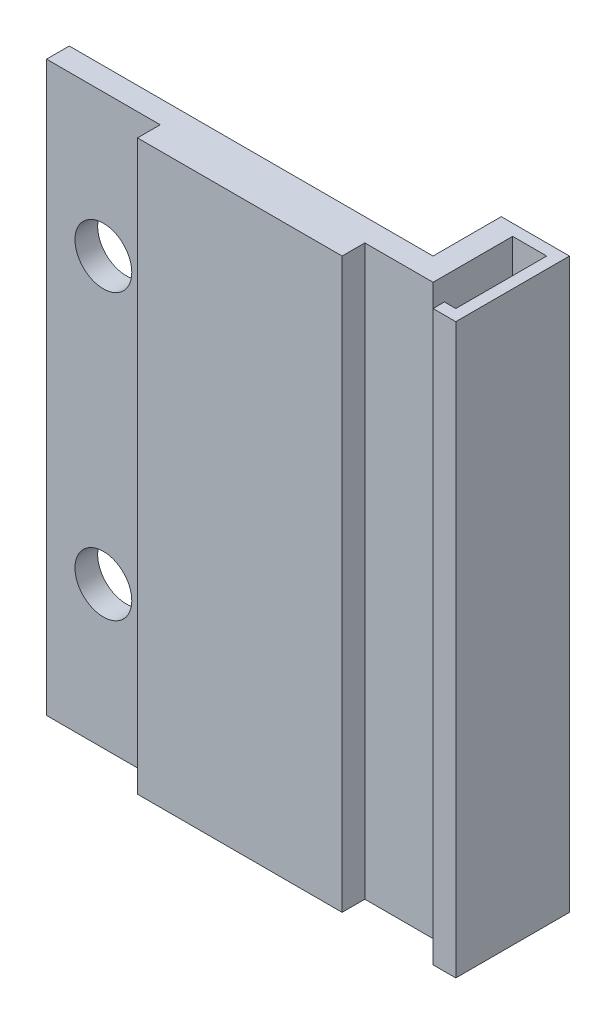
ISO-10303-21;
HEADER;
FILE_DESCRIPTION(('STEP AP214'),'2;1');
FILE_NAME('part.step','',(''),(''),'','','');
FILE_SCHEMA(('AUTOMOTIVE_DESIGN { 1 0 10303 214 1 1 1 1 }'));
ENDSEC;
DATA;
#1=APPLICATION_CONTEXT('core data for automotive mechanical design processes');
#2=APPLICATION_PROTOCOL_DEFINITION('international standard','automotive_design',2000,#1);
#3=PRODUCT_CONTEXT('',#1,'mechanical');
#4=PRODUCT('Part','Part','',(#3));
#5=PRODUCT_RELATED_PRODUCT_CATEGORY('part','',(#4));
#6=PRODUCT_DEFINITION_FORMATION('','',#4);
#7=PRODUCT_DEFINITION_CONTEXT('part definition',#1,'design');
#8=PRODUCT_DEFINITION('design','',#6,#7);
#9=PRODUCT_DEFINITION_SHAPE('','',#8);
#10=(LENGTH_UNIT() NAMED_UNIT(*) SI_UNIT(.MILLI.,.METRE.));
#11=(NAMED_UNIT(*) PLANE_ANGLE_UNIT() SI_UNIT($,.RADIAN.));
#12=(NAMED_UNIT(*) SI_UNIT($,.STERADIAN.) SOLID_ANGLE_UNIT());
#13=UNCERTAINTY_MEASURE_WITH_UNIT(LENGTH_MEASURE(1.E-05),#10,'distance_accuracy_value','');
#14=(GEOMETRIC_REPRESENTATION_CONTEXT(3) GLOBAL_UNCERTAINTY_ASSIGNED_CONTEXT((#13)) GLOBAL_UNIT_ASSIGNED_CONTEXT((#10,
#11,#12)) REPRESENTATION_CONTEXT('',''));
#15=CARTESIAN_POINT('',(0.,0.,0.));
#16=DIRECTION('',(0.,0.,1.));
#17=DIRECTION('',(1.,0.,0.));
#18=AXIS2_PLACEMENT_3D('',#15,#16,#17);
#19=CARTESIAN_POINT('',(37.,50.0000000000001,4.));
#20=DIRECTION('',(1.,0.,0.));
#21=DIRECTION('',(0.,1.,0.));
#22=AXIS2_PLACEMENT_3D('',#19,#20,#21);
#23=PLANE('',#22);
#24=DIRECTION('',(0.,-1.,0.));
#25=VECTOR('',#24,1.);
#26=CARTESIAN_POINT('',(37.,50.,3.));
#27=LINE('',#26,#25);
#28=CARTESIAN_POINT('',(37.,50.,3.));
#29=VERTEX_POINT('',#28);
#30=CARTESIAN_POINT('',(37.,0.,3.));
#31=VERTEX_POINT('',#30);
#32=EDGE_CURVE('E180',#29,#31,#27,.T.);
#33=ORIENTED_EDGE('',*,*,#32,.F.);
#34=DIRECTION('',(0.,0.,-1.));
#35=VECTOR('',#34,1.);
#36=CARTESIAN_POINT('',(37.,50.0000000000001,4.));
#37=LINE('',#36,#35);
#38=CARTESIAN_POINT('',(37.,50.0000000000001,-5.));
#39=VERTEX_POINT('',#38);
#40=EDGE_CURVE('E197',#29,#39,#37,.T.);
#41=ORIENTED_EDGE('',*,*,#40,.T.);
#42=DIRECTION('',(0.,-1.,0.));
#43=VECTOR('',#42,1.);
#44=CARTESIAN_POINT('',(37.,50.0000000000001,-5.));
#45=LINE('',#44,#43);
#46=CARTESIAN_POINT('',(37.,0.,-5.));
#47=VERTEX_POINT('',#46);
#48=EDGE_CURVE('E190',#39,#47,#45,.T.);
#49=ORIENTED_EDGE('',*,*,#48,.T.);
#50=DIRECTION('',(0.,0.,-1.));
#51=VECTOR('',#50,1.);
#52=CARTESIAN_POINT('',(36.9999999999999,0.,4.00000000000017));
#53=LINE('',#52,#51);
#54=EDGE_CURVE('E193',#31,#47,#53,.T.);
#55=ORIENTED_EDGE('',*,*,#54,.F.);
#56=EDGE_LOOP('',(#33,#41,#49,#55));
#57=FACE_BOUND('',#56,.T.);
#58=ADVANCED_FACE('F38',(#57),#23,.F.);
#59=CARTESIAN_POINT('',(38.,50.,-4.99999999999995));
#60=DIRECTION('',(0.,0.,-1.));
#61=DIRECTION('',(0.,1.,0.));
#62=AXIS2_PLACEMENT_3D('',#59,#60,#61);
#63=PLANE('',#62);
#64=ORIENTED_EDGE('',*,*,#48,.F.);
#65=DIRECTION('',(-1.,0.,0.));
#66=VECTOR('',#65,1.);
#67=CARTESIAN_POINT('',(38.,50.,-4.99999999999995));
#68=LINE('',#67,#66);
#69=CARTESIAN_POINT('',(34.,50.,-4.99999999999995));
#70=VERTEX_POINT('',#69);
#71=EDGE_CURVE('E53',#39,#70,#68,.T.);
#72=ORIENTED_EDGE('',*,*,#71,.T.);
#73=DIRECTION('',(0.,-1.,0.));
#74=VECTOR('',#73,1.);
#75=CARTESIAN_POINT('',(34.,50.,-4.99999999999995));
#76=LINE('',#75,#74);
#77=CARTESIAN_POINT('',(33.9999999999999,0.,-4.99999999999978));
#78=VERTEX_POINT('',#77);
#79=EDGE_CURVE('E199',#70,#78,#76,.T.);
#80=ORIENTED_EDGE('',*,*,#79,.T.);
#81=DIRECTION('',(-1.,0.,0.));
#82=VECTOR('',#81,1.);
#83=CARTESIAN_POINT('',(38.,0.,-5.));
#84=LINE('',#83,#82);
#85=EDGE_CURVE('E208',#47,#78,#84,.T.);
#86=ORIENTED_EDGE('',*,*,#85,.F.);
#87=EDGE_LOOP('',(#64,#72,#80,#86));
#88=FACE_BOUND('',#87,.T.);
#89=ADVANCED_FACE('F326',(#88),#63,.F.);
#90=CARTESIAN_POINT('',(0.,0.,4.00000000000011));
#91=DIRECTION('',(0.,0.,-1.));
#92=DIRECTION('',(-1.,0.,0.));
#93=AXIS2_PLACEMENT_3D('',#90,#91,#92);
#94=PLANE('',#93);
#95=DIRECTION('',(0.,-1.,0.));
#96=VECTOR('',#95,1.);
#97=CARTESIAN_POINT('',(28.,50.,4.));
#98=LINE('',#97,#96);
#99=CARTESIAN_POINT('',(28.,50.,4.));
#100=VERTEX_POINT('',#99);
#101=CARTESIAN_POINT('',(28.,0.,4.));
#102=VERTEX_POINT('',#101);
#103=EDGE_CURVE('E213',#100,#102,#98,.T.);
#104=ORIENTED_EDGE('',*,*,#103,.F.);
#105=DIRECTION('',(-1.,0.,0.));
#106=VECTOR('',#105,1.);
#107=CARTESIAN_POINT('',(12.,50.,4.));
#108=LINE('',#107,#106);
#109=CARTESIAN_POINT('',(9.99999999999998,50.,4.00000000000017));
#110=VERTEX_POINT('',#109);
#111=EDGE_CURVE('E248',#100,#110,#108,.T.);
#112=ORIENTED_EDGE('',*,*,#111,.T.);
#113=DIRECTION('',(0.,-1.,0.));
#114=VECTOR('',#113,1.);
#115=CARTESIAN_POINT('',(9.99999999999998,50.,4.00000000000017));
#116=LINE('',#115,#114);
#117=CARTESIAN_POINT('',(9.99999999999993,0.,4.00000000000023));
#118=VERTEX_POINT('',#117);
#119=EDGE_CURVE('E250',#110,#118,#116,.T.);
#120=ORIENTED_EDGE('',*,*,#119,.T.);
#121=DIRECTION('',(1.,0.,0.));
#122=VECTOR('',#121,1.);
#123=CARTESIAN_POINT('',(12.,0.,4.));
#124=LINE('',#123,#122);
#125=EDGE_CURVE('E252',#118,#102,#124,.T.);
#126=ORIENTED_EDGE('',*,*,#125,.T.);
#127=EDGE_LOOP('',(#104,#112,#120,#126));
#128=FACE_BOUND('',#127,.T.);
#129=ADVANCED_FACE('F332',(#128),#94,.F.);
#130=CARTESIAN_POINT('',(0.,0.,0.));
#131=DIRECTION('',(0.,0.,1.));
#132=DIRECTION('',(1.,0.,0.));
#133=AXIS2_PLACEMENT_3D('',#130,#131,#132);
#134=PLANE('',#133);
#135=CARTESIAN_POINT('',(4.99999999999995,12.5,1.11022302462516E-13));
#136=DIRECTION('',(0.,0.,1.));
#137=DIRECTION('',(1.,0.,0.));
#138=AXIS2_PLACEMENT_3D('',#135,#136,#137);
#139=CIRCLE('',#138,2.5);
#140=CARTESIAN_POINT('',(7.49999999999995,12.5,1.10467190950203E-13));
#141=VERTEX_POINT('',#140);
#142=EDGE_CURVE('E281',#141,#141,#139,.T.);
#143=ORIENTED_EDGE('',*,*,#142,.T.);
#144=EDGE_LOOP('',(#143));
#145=FACE_BOUND('',#144,.T.);
#146=CARTESIAN_POINT('',(4.99999999999998,37.5,0.));
#147=DIRECTION('',(0.,0.,1.));
#148=DIRECTION('',(1.,0.,0.));
#149=AXIS2_PLACEMENT_3D('',#146,#147,#148);
#150=CIRCLE('',#149,2.5);
#151=CARTESIAN_POINT('',(7.49999999999998,37.5,0.));
#152=VERTEX_POINT('',#151);
#153=EDGE_CURVE('E263',#152,#152,#150,.T.);
#154=ORIENTED_EDGE('',*,*,#153,.T.);
#155=EDGE_LOOP('',(#154));
#156=FACE_BOUND('',#155,.T.);
#157=DIRECTION('',(0.,1.,0.));
#158=VECTOR('',#157,1.);
#159=CARTESIAN_POINT('',(31.9999999999999,50.,1.11022302462516E-13));
#160=LINE('',#159,#158);
#161=CARTESIAN_POINT('',(32.,0.,0.));
#162=VERTEX_POINT('',#161);
#163=CARTESIAN_POINT('',(31.9999999999999,50.,1.11022302462516E-13));
#164=VERTEX_POINT('',#163);
#165=EDGE_CURVE('E226',#162,#164,#160,.T.);
#166=ORIENTED_EDGE('',*,*,#165,.F.);
#167=DIRECTION('',(1.,0.,0.));
#168=VECTOR('',#167,1.);
#169=CARTESIAN_POINT('',(0.,0.,0.));
#170=LINE('',#169,#168);
#171=CARTESIAN_POINT('',(0.,0.,0.));
#172=VERTEX_POINT('',#171);
#173=EDGE_CURVE('E268',#172,#162,#170,.T.);
#174=ORIENTED_EDGE('',*,*,#173,.F.);
#175=DIRECTION('',(0.,1.,0.));
#176=VECTOR('',#175,1.);
#177=CARTESIAN_POINT('',(0.,0.,0.));
#178=LINE('',#177,#176);
#179=CARTESIAN_POINT('',(0.,50.0000000000001,1.11022302462516E-13));
#180=VERTEX_POINT('',#179);
#181=EDGE_CURVE('E286',#172,#180,#178,.T.);
#182=ORIENTED_EDGE('',*,*,#181,.T.);
#183=DIRECTION('',(1.,0.,0.));
#184=VECTOR('',#183,1.);
#185=CARTESIAN_POINT('',(0.,50.0000000000001,1.11022302462516E-13));
#186=LINE('',#185,#184);
#187=EDGE_CURVE('E284',#180,#164,#186,.T.);
#188=ORIENTED_EDGE('',*,*,#187,.T.);
#189=EDGE_LOOP('',(#166,#174,#182,#188));
#190=FACE_BOUND('',#189,.T.);
#191=ADVANCED_FACE('F300',(#145,#156,#190),#134,.F.);
#192=CARTESIAN_POINT('',(0.,50.,2.));
#193=DIRECTION('',(0.,1.,0.));
#194=DIRECTION('',(0.,0.,1.));
#195=AXIS2_PLACEMENT_3D('',#192,#193,#194);
#196=PLANE('',#195);
#197=DIRECTION('',(1.,0.,0.));
#198=VECTOR('',#197,1.);
#199=CARTESIAN_POINT('',(28.,49.9999999999999,2.00000000000006));
#200=LINE('',#199,#198);
#201=CARTESIAN_POINT('',(28.,49.9999999999999,2.00000000000006));
#202=VERTEX_POINT('',#201);
#203=CARTESIAN_POINT('',(33.9999999999999,50.,2.00000000000017));
#204=VERTEX_POINT('',#203);
#205=EDGE_CURVE('E224',#202,#204,#200,.T.);
#206=ORIENTED_EDGE('',*,*,#205,.T.);
#207=DIRECTION('',(0.,0.,1.));
#208=VECTOR('',#207,1.);
#209=CARTESIAN_POINT('',(33.9999999999999,50.,4.00000000000006));
#210=LINE('',#209,#208);
#211=EDGE_CURVE('E245',#70,#204,#210,.T.);
#212=ORIENTED_EDGE('',*,*,#211,.F.);
#213=ORIENTED_EDGE('',*,*,#71,.F.);
#214=ORIENTED_EDGE('',*,*,#40,.F.);
#215=DIRECTION('',(1.,0.,0.));
#216=VECTOR('',#215,1.);
#217=CARTESIAN_POINT('',(36.,50.,3.));
#218=LINE('',#217,#216);
#219=CARTESIAN_POINT('',(36.,50.,3.));
#220=VERTEX_POINT('',#219);
#221=EDGE_CURVE('E171',#220,#29,#218,.T.);
#222=ORIENTED_EDGE('',*,*,#221,.F.);
#223=DIRECTION('',(0.,0.,-1.));
#224=VECTOR('',#223,1.);
#225=CARTESIAN_POINT('',(36.,50.,4.));
#226=LINE('',#225,#224);
#227=CARTESIAN_POINT('',(36.,50.,4.));
#228=VERTEX_POINT('',#227);
#229=EDGE_CURVE('E167',#228,#220,#226,.T.);
#230=ORIENTED_EDGE('',*,*,#229,.F.);
#231=DIRECTION('',(-1.,0.,0.));
#232=VECTOR('',#231,1.);
#233=CARTESIAN_POINT('',(38.,50.,4.));
#234=LINE('',#233,#232);
#235=CARTESIAN_POINT('',(38.,50.,4.));
#236=VERTEX_POINT('',#235);
#237=EDGE_CURVE('E154',#236,#228,#234,.T.);
#238=ORIENTED_EDGE('',*,*,#237,.F.);
#239=DIRECTION('',(0.,0.,1.));
#240=VECTOR('',#239,1.);
#241=CARTESIAN_POINT('',(38.,50.,-6.00000000000001));
#242=LINE('',#241,#240);
#243=CARTESIAN_POINT('',(38.,50.,-6.00000000000001));
#244=VERTEX_POINT('',#243);
#245=EDGE_CURVE('E203',#244,#236,#242,.T.);
#246=ORIENTED_EDGE('',*,*,#245,.F.);
#247=DIRECTION('',(1.,0.,0.));
#248=VECTOR('',#247,1.);
#249=CARTESIAN_POINT('',(33.9999999999999,49.9999999999999,-5.99999999999995));
#250=LINE('',#249,#248);
#251=CARTESIAN_POINT('',(31.9999999999999,50.,-5.99999999999995));
#252=VERTEX_POINT('',#251);
#253=EDGE_CURVE('E232',#252,#244,#250,.T.);
#254=ORIENTED_EDGE('',*,*,#253,.F.);
#255=DIRECTION('',(0.,0.,1.));
#256=VECTOR('',#255,1.);
#257=CARTESIAN_POINT('',(31.9999999999999,50.,-5.99999999999995));
#258=LINE('',#257,#256);
#259=EDGE_CURVE('E234',#252,#164,#258,.T.);
#260=ORIENTED_EDGE('',*,*,#259,.T.);
#261=ORIENTED_EDGE('',*,*,#187,.F.);
#262=DIRECTION('',(0.,0.,-1.));
#263=VECTOR('',#262,1.);
#264=CARTESIAN_POINT('',(0.,50.,2.));
#265=LINE('',#264,#263);
#266=CARTESIAN_POINT('',(0.,50.,2.));
#267=VERTEX_POINT('',#266);
#268=EDGE_CURVE('E11',#267,#180,#265,.T.);
#269=ORIENTED_EDGE('',*,*,#268,.F.);
#270=DIRECTION('',(1.,0.,0.));
#271=VECTOR('',#270,1.);
#272=CARTESIAN_POINT('',(0.,50.,2.));
#273=LINE('',#272,#271);
#274=CARTESIAN_POINT('',(9.99999999999998,50.,2.00000000000006));
#275=VERTEX_POINT('',#274);
#276=EDGE_CURVE('E271',#267,#275,#273,.T.);
#277=ORIENTED_EDGE('',*,*,#276,.T.);
#278=DIRECTION('',(0.,0.,-1.));
#279=VECTOR('',#278,1.);
#280=CARTESIAN_POINT('',(9.99999999999998,50.,4.00000000000017));
#281=LINE('',#280,#279);
#282=EDGE_CURVE('E260',#110,#275,#281,.T.);
#283=ORIENTED_EDGE('',*,*,#282,.F.);
#284=ORIENTED_EDGE('',*,*,#111,.F.);
#285=DIRECTION('',(0.,0.,1.));
#286=VECTOR('',#285,1.);
#287=CARTESIAN_POINT('',(28.,50.,4.));
#288=LINE('',#287,#286);
#289=EDGE_CURVE('E221',#202,#100,#288,.T.);
#290=ORIENTED_EDGE('',*,*,#289,.F.);
#291=EDGE_LOOP('',(#206,#212,#213,#214,#222,#230,#238,#246,#254,#260,#261,#269,#277,#283,#284,#290));
#292=FACE_BOUND('',#291,.T.);
#293=ADVANCED_FACE('F169',(#292),#196,.T.);
#294=CARTESIAN_POINT('',(0.,0.,2.00000000000006));
#295=DIRECTION('',(-1.,0.,0.));
#296=DIRECTION('',(0.,0.,1.));
#297=AXIS2_PLACEMENT_3D('',#294,#295,#296);
#298=PLANE('',#297);
#299=ORIENTED_EDGE('',*,*,#181,.F.);
#300=DIRECTION('',(0.,0.,-1.));
#301=VECTOR('',#300,1.);
#302=CARTESIAN_POINT('',(0.,0.,2.00000000000006));
#303=LINE('',#302,#301);
#304=CARTESIAN_POINT('',(0.,0.,2.00000000000006));
#305=VERTEX_POINT('',#304);
#306=EDGE_CURVE('E46',#305,#172,#303,.T.);
#307=ORIENTED_EDGE('',*,*,#306,.F.);
#308=DIRECTION('',(0.,1.,0.));
#309=VECTOR('',#308,1.);
#310=CARTESIAN_POINT('',(0.,0.,2.00000000000006));
#311=LINE('',#310,#309);
#312=EDGE_CURVE('E274',#305,#267,#311,.T.);
#313=ORIENTED_EDGE('',*,*,#312,.T.);
#314=ORIENTED_EDGE('',*,*,#268,.T.);
#315=EDGE_LOOP('',(#299,#307,#313,#314));
#316=FACE_BOUND('',#315,.T.);
#317=ADVANCED_FACE('F301',(#316),#298,.T.);
#318=CARTESIAN_POINT('',(0.,0.,2.00000000000006));
#319=DIRECTION('',(0.,1.,0.));
#320=DIRECTION('',(0.,0.,1.));
#321=AXIS2_PLACEMENT_3D('',#318,#319,#320);
#322=PLANE('',#321);
#323=DIRECTION('',(0.,0.,-1.));
#324=VECTOR('',#323,1.);
#325=CARTESIAN_POINT('',(34.,0.,4.00000000000011));
#326=LINE('',#325,#324);
#327=CARTESIAN_POINT('',(34.,0.,2.));
#328=VERTEX_POINT('',#327);
#329=EDGE_CURVE('E242',#328,#78,#326,.T.);
#330=ORIENTED_EDGE('',*,*,#329,.F.);
#331=DIRECTION('',(1.,0.,0.));
#332=VECTOR('',#331,1.);
#333=CARTESIAN_POINT('',(28.,0.,2.));
#334=LINE('',#333,#332);
#335=CARTESIAN_POINT('',(28.,0.,2.));
#336=VERTEX_POINT('',#335);
#337=EDGE_CURVE('E61',#336,#328,#334,.T.);
#338=ORIENTED_EDGE('',*,*,#337,.F.);
#339=DIRECTION('',(0.,0.,-1.));
#340=VECTOR('',#339,1.);
#341=CARTESIAN_POINT('',(28.,0.,4.));
#342=LINE('',#341,#340);
#343=EDGE_CURVE('E215',#102,#336,#342,.T.);
#344=ORIENTED_EDGE('',*,*,#343,.F.);
#345=ORIENTED_EDGE('',*,*,#125,.F.);
#346=DIRECTION('',(0.,0.,-1.));
#347=VECTOR('',#346,1.);
#348=CARTESIAN_POINT('',(9.99999999999993,0.,4.00000000000023));
#349=LINE('',#348,#347);
#350=CARTESIAN_POINT('',(10.,0.,2.));
#351=VERTEX_POINT('',#350);
#352=EDGE_CURVE('E255',#118,#351,#349,.T.);
#353=ORIENTED_EDGE('',*,*,#352,.T.);
#354=DIRECTION('',(1.,0.,0.));
#355=VECTOR('',#354,1.);
#356=CARTESIAN_POINT('',(0.,0.,2.00000000000006));
#357=LINE('',#356,#355);
#358=EDGE_CURVE('E277',#305,#351,#357,.T.);
#359=ORIENTED_EDGE('',*,*,#358,.F.);
#360=ORIENTED_EDGE('',*,*,#306,.T.);
#361=ORIENTED_EDGE('',*,*,#173,.T.);
#362=DIRECTION('',(0.,0.,1.));
#363=VECTOR('',#362,1.);
#364=CARTESIAN_POINT('',(32.,0.,-6.00000000000001));
#365=LINE('',#364,#363);
#366=CARTESIAN_POINT('',(32.,0.,-6.00000000000001));
#367=VERTEX_POINT('',#366);
#368=EDGE_CURVE('E239',#367,#162,#365,.T.);
#369=ORIENTED_EDGE('',*,*,#368,.F.);
#370=DIRECTION('',(-1.,0.,0.));
#371=VECTOR('',#370,1.);
#372=CARTESIAN_POINT('',(34.,0.,-5.99999999999989));
#373=LINE('',#372,#371);
#374=CARTESIAN_POINT('',(38.,0.,-6.00000000000001));
#375=VERTEX_POINT('',#374);
#376=EDGE_CURVE('E228',#375,#367,#373,.T.);
#377=ORIENTED_EDGE('',*,*,#376,.F.);
#378=DIRECTION('',(0.,0.,-1.));
#379=VECTOR('',#378,1.);
#380=CARTESIAN_POINT('',(38.,0.,-6.00000000000001));
#381=LINE('',#380,#379);
#382=CARTESIAN_POINT('',(38.,0.,4.));
#383=VERTEX_POINT('',#382);
#384=EDGE_CURVE('E205',#383,#375,#381,.T.);
#385=ORIENTED_EDGE('',*,*,#384,.F.);
#386=DIRECTION('',(1.,0.,0.));
#387=VECTOR('',#386,1.);
#388=CARTESIAN_POINT('',(38.,0.,4.));
#389=LINE('',#388,#387);
#390=CARTESIAN_POINT('',(35.9999999999999,0.,4.00000000000006));
#391=VERTEX_POINT('',#390);
#392=EDGE_CURVE('E164',#391,#383,#389,.T.);
#393=ORIENTED_EDGE('',*,*,#392,.F.);
#394=DIRECTION('',(0.,0.,1.));
#395=VECTOR('',#394,1.);
#396=CARTESIAN_POINT('',(35.9999999999999,0.,4.00000000000006));
#397=LINE('',#396,#395);
#398=CARTESIAN_POINT('',(36.,0.,3.00000000000006));
#399=VERTEX_POINT('',#398);
#400=EDGE_CURVE('E179',#399,#391,#397,.T.);
#401=ORIENTED_EDGE('',*,*,#400,.F.);
#402=DIRECTION('',(1.,0.,0.));
#403=VECTOR('',#402,1.);
#404=CARTESIAN_POINT('',(36.,0.,3.00000000000006));
#405=LINE('',#404,#403);
#406=EDGE_CURVE('E185',#399,#31,#405,.T.);
#407=ORIENTED_EDGE('',*,*,#406,.T.);
#408=ORIENTED_EDGE('',*,*,#54,.T.);
#409=ORIENTED_EDGE('',*,*,#85,.T.);
#410=EDGE_LOOP('',(#330,#338,#344,#345,#353,#359,#360,#361,#369,#377,#385,#393,#401,#407,#408,#409));
#411=FACE_BOUND('',#410,.T.);
#412=ADVANCED_FACE('F294',(#411),#322,.F.);
#413=CARTESIAN_POINT('',(5.,12.5,2.));
#414=DIRECTION('',(0.,0.,-1.));
#415=DIRECTION('',(-1.,0.,0.));
#416=AXIS2_PLACEMENT_3D('',#413,#414,#415);
#417=CYLINDRICAL_SURFACE('',#416,2.5);
#418=CARTESIAN_POINT('',(5.,12.5,2.));
#419=DIRECTION('',(0.,0.,1.));
#420=DIRECTION('',(1.,0.,0.));
#421=AXIS2_PLACEMENT_3D('',#418,#419,#420);
#422=CIRCLE('',#421,2.5);
#423=CARTESIAN_POINT('',(7.50000000000001,12.5,2.));
#424=VERTEX_POINT('',#423);
#425=EDGE_CURVE('E267',#424,#424,#422,.T.);
#426=ORIENTED_EDGE('',*,*,#425,.T.);
#427=EDGE_LOOP('',(#426));
#428=FACE_BOUND('',#427,.T.);
#429=ORIENTED_EDGE('',*,*,#142,.F.);
#430=EDGE_LOOP('',(#429));
#431=FACE_BOUND('',#430,.T.);
#432=ADVANCED_FACE('F443',(#428,#431),#417,.F.);
#433=CARTESIAN_POINT('',(5.,37.5000000000001,2.));
#434=DIRECTION('',(0.,0.,-1.));
#435=DIRECTION('',(-1.,0.,0.));
#436=AXIS2_PLACEMENT_3D('',#433,#434,#435);
#437=CYLINDRICAL_SURFACE('',#436,2.5);
#438=CARTESIAN_POINT('',(5.,37.5000000000001,2.));
#439=DIRECTION('',(0.,0.,1.));
#440=DIRECTION('',(1.,0.,0.));
#441=AXIS2_PLACEMENT_3D('',#438,#439,#440);
#442=CIRCLE('',#441,2.5);
#443=CARTESIAN_POINT('',(7.5,37.5000000000001,2.));
#444=VERTEX_POINT('',#443);
#445=EDGE_CURVE('E264',#444,#444,#442,.T.);
#446=ORIENTED_EDGE('',*,*,#445,.T.);
#447=EDGE_LOOP('',(#446));
#448=FACE_BOUND('',#447,.T.);
#449=ORIENTED_EDGE('',*,*,#153,.F.);
#450=EDGE_LOOP('',(#449));
#451=FACE_BOUND('',#450,.T.);
#452=ADVANCED_FACE('F40',(#448,#451),#437,.F.);
#453=CARTESIAN_POINT('',(0.,0.,2.00000000000006));
#454=DIRECTION('',(0.,0.,1.));
#455=DIRECTION('',(1.,0.,0.));
#456=AXIS2_PLACEMENT_3D('',#453,#454,#455);
#457=PLANE('',#456);
#458=DIRECTION('',(0.,-1.,0.));
#459=VECTOR('',#458,1.);
#460=CARTESIAN_POINT('',(9.99999999999998,50.,2.00000000000006));
#461=LINE('',#460,#459);
#462=EDGE_CURVE('E247',#275,#351,#461,.T.);
#463=ORIENTED_EDGE('',*,*,#462,.F.);
#464=ORIENTED_EDGE('',*,*,#276,.F.);
#465=ORIENTED_EDGE('',*,*,#312,.F.);
#466=ORIENTED_EDGE('',*,*,#358,.T.);
#467=EDGE_LOOP('',(#463,#464,#465,#466));
#468=FACE_BOUND('',#467,.T.);
#469=ORIENTED_EDGE('',*,*,#445,.F.);
#470=EDGE_LOOP('',(#469));
#471=FACE_BOUND('',#470,.T.);
#472=ORIENTED_EDGE('',*,*,#425,.F.);
#473=EDGE_LOOP('',(#472));
#474=FACE_BOUND('',#473,.T.);
#475=ADVANCED_FACE('F356',(#468,#471,#474),#457,.T.);
#476=CARTESIAN_POINT('',(9.99999999999998,50.,4.00000000000017));
#477=DIRECTION('',(1.,0.,0.));
#478=DIRECTION('',(0.,1.,0.));
#479=AXIS2_PLACEMENT_3D('',#476,#477,#478);
#480=PLANE('',#479);
#481=ORIENTED_EDGE('',*,*,#462,.T.);
#482=ORIENTED_EDGE('',*,*,#352,.F.);
#483=ORIENTED_EDGE('',*,*,#119,.F.);
#484=ORIENTED_EDGE('',*,*,#282,.T.);
#485=EDGE_LOOP('',(#481,#482,#483,#484));
#486=FACE_BOUND('',#485,.T.);
#487=ADVANCED_FACE('F354',(#486),#480,.F.);
#488=CARTESIAN_POINT('',(34.,0.,0.));
#489=DIRECTION('',(1.,0.,0.));
#490=DIRECTION('',(0.,0.,-1.));
#491=AXIS2_PLACEMENT_3D('',#488,#489,#490);
#492=PLANE('',#491);
#493=ORIENTED_EDGE('',*,*,#79,.F.);
#494=ORIENTED_EDGE('',*,*,#211,.T.);
#495=DIRECTION('',(0.,1.,0.));
#496=VECTOR('',#495,1.);
#497=CARTESIAN_POINT('',(33.9999999999999,50.,2.00000000000017));
#498=LINE('',#497,#496);
#499=EDGE_CURVE('E212',#328,#204,#498,.T.);
#500=ORIENTED_EDGE('',*,*,#499,.F.);
#501=ORIENTED_EDGE('',*,*,#329,.T.);
#502=EDGE_LOOP('',(#493,#494,#500,#501));
#503=FACE_BOUND('',#502,.T.);
#504=ADVANCED_FACE('F323',(#503),#492,.T.);
#505=CARTESIAN_POINT('',(31.9999999999999,50.,-5.99999999999995));
#506=DIRECTION('',(1.,0.,0.));
#507=DIRECTION('',(0.,1.,0.));
#508=AXIS2_PLACEMENT_3D('',#505,#506,#507);
#509=PLANE('',#508);
#510=ORIENTED_EDGE('',*,*,#165,.T.);
#511=ORIENTED_EDGE('',*,*,#259,.F.);
#512=DIRECTION('',(0.,1.,0.));
#513=VECTOR('',#512,1.);
#514=CARTESIAN_POINT('',(31.9999999999999,50.,-5.99999999999995));
#515=LINE('',#514,#513);
#516=EDGE_CURVE('E230',#367,#252,#515,.T.);
#517=ORIENTED_EDGE('',*,*,#516,.F.);
#518=ORIENTED_EDGE('',*,*,#368,.T.);
#519=EDGE_LOOP('',(#510,#511,#517,#518));
#520=FACE_BOUND('',#519,.T.);
#521=ADVANCED_FACE('F307',(#520),#509,.F.);
#522=CARTESIAN_POINT('',(0.,0.,-6.00000000000001));
#523=DIRECTION('',(0.,0.,-1.));
#524=DIRECTION('',(-1.,0.,0.));
#525=AXIS2_PLACEMENT_3D('',#522,#523,#524);
#526=PLANE('',#525);
#527=ORIENTED_EDGE('',*,*,#253,.T.);
#528=DIRECTION('',(0.,1.,0.));
#529=VECTOR('',#528,1.);
#530=CARTESIAN_POINT('',(38.,50.,-6.00000000000001));
#531=LINE('',#530,#529);
#532=EDGE_CURVE('E200',#375,#244,#531,.T.);
#533=ORIENTED_EDGE('',*,*,#532,.F.);
#534=ORIENTED_EDGE('',*,*,#376,.T.);
#535=ORIENTED_EDGE('',*,*,#516,.T.);
#536=EDGE_LOOP('',(#527,#533,#534,#535));
#537=FACE_BOUND('',#536,.T.);
#538=ADVANCED_FACE('F313',(#537),#526,.T.);
#539=CARTESIAN_POINT('',(28.,49.9999999999999,2.00000000000006));
#540=DIRECTION('',(0.,0.,-1.));
#541=DIRECTION('',(-1.,0.,0.));
#542=AXIS2_PLACEMENT_3D('',#539,#540,#541);
#543=PLANE('',#542);
#544=ORIENTED_EDGE('',*,*,#499,.T.);
#545=ORIENTED_EDGE('',*,*,#205,.F.);
#546=DIRECTION('',(0.,1.,0.));
#547=VECTOR('',#546,1.);
#548=CARTESIAN_POINT('',(28.,49.9999999999999,2.00000000000006));
#549=LINE('',#548,#547);
#550=EDGE_CURVE('E218',#336,#202,#549,.T.);
#551=ORIENTED_EDGE('',*,*,#550,.F.);
#552=ORIENTED_EDGE('',*,*,#337,.T.);
#553=EDGE_LOOP('',(#544,#545,#551,#552));
#554=FACE_BOUND('',#553,.T.);
#555=ADVANCED_FACE('F315',(#554),#543,.F.);
#556=CARTESIAN_POINT('',(28.,0.,0.));
#557=DIRECTION('',(1.,0.,0.));
#558=DIRECTION('',(0.,0.,-1.));
#559=AXIS2_PLACEMENT_3D('',#556,#557,#558);
#560=PLANE('',#559);
#561=ORIENTED_EDGE('',*,*,#103,.T.);
#562=ORIENTED_EDGE('',*,*,#343,.T.);
#563=ORIENTED_EDGE('',*,*,#550,.T.);
#564=ORIENTED_EDGE('',*,*,#289,.T.);
#565=EDGE_LOOP('',(#561,#562,#563,#564));
#566=FACE_BOUND('',#565,.T.);
#567=ADVANCED_FACE('F321',(#566),#560,.T.);
#568=CARTESIAN_POINT('',(38.,0.,2.22044604925031E-13));
#569=DIRECTION('',(-1.,0.,0.));
#570=DIRECTION('',(0.,0.,1.));
#571=AXIS2_PLACEMENT_3D('',#568,#569,#570);
#572=PLANE('',#571);
#573=ORIENTED_EDGE('',*,*,#532,.T.);
#574=ORIENTED_EDGE('',*,*,#245,.T.);
#575=DIRECTION('',(0.,1.,0.));
#576=VECTOR('',#575,1.);
#577=CARTESIAN_POINT('',(38.,50.,4.));
#578=LINE('',#577,#576);
#579=EDGE_CURVE('E161',#383,#236,#578,.T.);
#580=ORIENTED_EDGE('',*,*,#579,.F.);
#581=ORIENTED_EDGE('',*,*,#384,.T.);
#582=EDGE_LOOP('',(#573,#574,#580,#581));
#583=FACE_BOUND('',#582,.T.);
#584=ADVANCED_FACE('F312',(#583),#572,.F.);
#585=CARTESIAN_POINT('',(0.,0.,4.00000000000011));
#586=DIRECTION('',(0.,0.,-1.));
#587=DIRECTION('',(-1.,0.,0.));
#588=AXIS2_PLACEMENT_3D('',#585,#586,#587);
#589=PLANE('',#588);
#590=ORIENTED_EDGE('',*,*,#579,.T.);
#591=ORIENTED_EDGE('',*,*,#237,.T.);
#592=DIRECTION('',(0.,1.,0.));
#593=VECTOR('',#592,1.);
#594=CARTESIAN_POINT('',(36.,50.,4.));
#595=LINE('',#594,#593);
#596=EDGE_CURVE('E159',#391,#228,#595,.T.);
#597=ORIENTED_EDGE('',*,*,#596,.F.);
#598=ORIENTED_EDGE('',*,*,#392,.T.);
#599=EDGE_LOOP('',(#590,#591,#597,#598));
#600=FACE_BOUND('',#599,.T.);
#601=ADVANCED_FACE('F156',(#600),#589,.F.);
#602=CARTESIAN_POINT('',(36.,50.,3.));
#603=DIRECTION('',(0.,0.,1.));
#604=DIRECTION('',(0.,-1.,0.));
#605=AXIS2_PLACEMENT_3D('',#602,#603,#604);
#606=PLANE('',#605);
#607=ORIENTED_EDGE('',*,*,#32,.T.);
#608=ORIENTED_EDGE('',*,*,#406,.F.);
#609=DIRECTION('',(0.,-1.,0.));
#610=VECTOR('',#609,1.);
#611=CARTESIAN_POINT('',(36.,50.,3.));
#612=LINE('',#611,#610);
#613=EDGE_CURVE('E174',#220,#399,#612,.T.);
#614=ORIENTED_EDGE('',*,*,#613,.F.);
#615=ORIENTED_EDGE('',*,*,#221,.T.);
#616=EDGE_LOOP('',(#607,#608,#614,#615));
#617=FACE_BOUND('',#616,.T.);
#618=ADVANCED_FACE('F364',(#617),#606,.F.);
#619=CARTESIAN_POINT('',(35.9999999999999,0.,1.11022302462516E-13));
#620=DIRECTION('',(1.,0.,0.));
#621=DIRECTION('',(0.,1.,0.));
#622=AXIS2_PLACEMENT_3D('',#619,#620,#621);
#623=PLANE('',#622);
#624=ORIENTED_EDGE('',*,*,#596,.T.);
#625=ORIENTED_EDGE('',*,*,#229,.T.);
#626=ORIENTED_EDGE('',*,*,#613,.T.);
#627=ORIENTED_EDGE('',*,*,#400,.T.);
#628=EDGE_LOOP('',(#624,#625,#626,#627));
#629=FACE_BOUND('',#628,.T.);
#630=ADVANCED_FACE('F177',(#629),#623,.F.);
#631=CLOSED_SHELL('',(#58,#89,#129,#191,#293,#317,#412,#432,#452,#475,#487,#504,#521,#538,#555,
#567,#584,#601,#618,#630));
#632=MANIFOLD_SOLID_BREP('B2',#631);
#633=ADVANCED_BREP_SHAPE_REPRESENTATION('',(#18,#632),#14);
#634=SHAPE_DEFINITION_REPRESENTATION(#9,#633);
ENDSEC;
END-ISO-10303-21;
